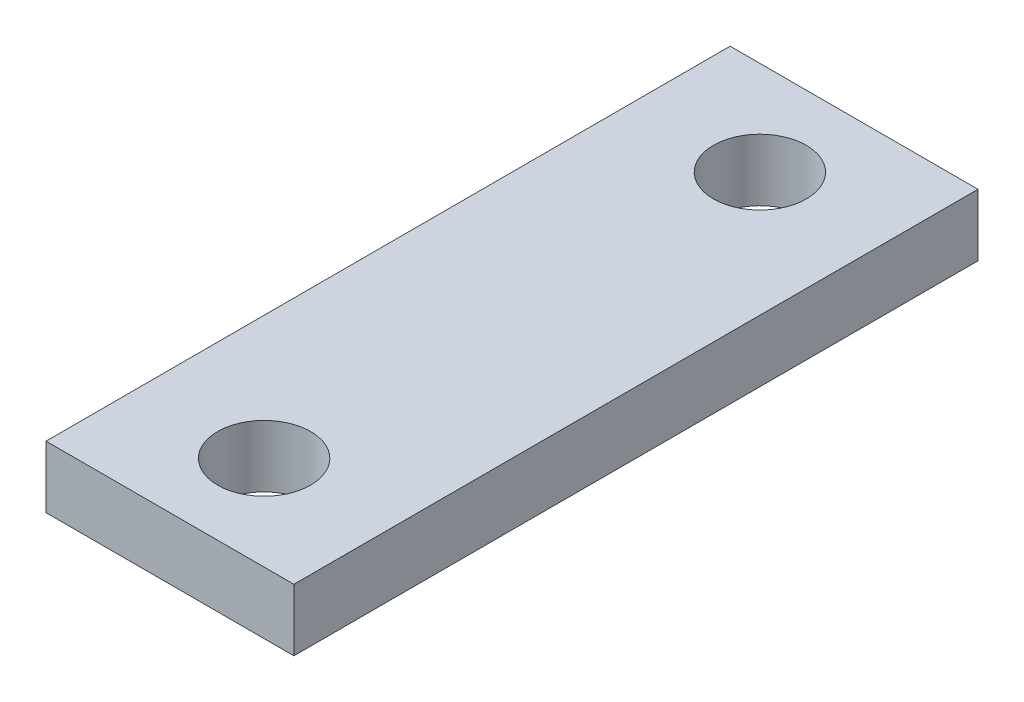
ISO-10303-21;
HEADER;
FILE_DESCRIPTION(('STEP AP214'),'2;1');
FILE_NAME('part.step','',(''),(''),'','','');
FILE_SCHEMA(('AUTOMOTIVE_DESIGN { 1 0 10303 214 1 1 1 1 }'));
ENDSEC;
DATA;
#1=APPLICATION_CONTEXT('core data for automotive mechanical design processes');
#2=APPLICATION_PROTOCOL_DEFINITION('international standard','automotive_design',2000,#1);
#3=PRODUCT_CONTEXT('',#1,'mechanical');
#4=PRODUCT('Part','Part','',(#3));
#5=PRODUCT_RELATED_PRODUCT_CATEGORY('part','',(#4));
#6=PRODUCT_DEFINITION_FORMATION('','',#4);
#7=PRODUCT_DEFINITION_CONTEXT('part definition',#1,'design');
#8=PRODUCT_DEFINITION('design','',#6,#7);
#9=PRODUCT_DEFINITION_SHAPE('','',#8);
#10=(LENGTH_UNIT() NAMED_UNIT(*) SI_UNIT(.MILLI.,.METRE.));
#11=(NAMED_UNIT(*) PLANE_ANGLE_UNIT() SI_UNIT($,.RADIAN.));
#12=(NAMED_UNIT(*) SI_UNIT($,.STERADIAN.) SOLID_ANGLE_UNIT());
#13=UNCERTAINTY_MEASURE_WITH_UNIT(LENGTH_MEASURE(1.E-05),#10,'distance_accuracy_value','');
#14=(GEOMETRIC_REPRESENTATION_CONTEXT(3) GLOBAL_UNCERTAINTY_ASSIGNED_CONTEXT((#13)) GLOBAL_UNIT_ASSIGNED_CONTEXT((#10,
#11,#12)) REPRESENTATION_CONTEXT('',''));
#15=CARTESIAN_POINT('',(0.,0.,0.));
#16=DIRECTION('',(0.,0.,1.));
#17=DIRECTION('',(1.,0.,0.));
#18=AXIS2_PLACEMENT_3D('',#15,#16,#17);
#19=CARTESIAN_POINT('',(-12.7,6.35,0.));
#20=DIRECTION('',(1.,0.,0.));
#21=DIRECTION('',(0.,0.,-1.));
#22=AXIS2_PLACEMENT_3D('',#19,#20,#21);
#23=PLANE('',#22);
#24=DIRECTION('',(0.,0.,1.));
#25=VECTOR('',#24,1.);
#26=CARTESIAN_POINT('',(-12.7,0.,0.));
#27=LINE('',#26,#25);
#28=CARTESIAN_POINT('',(-12.7,0.,-35.052));
#29=VERTEX_POINT('',#28);
#30=CARTESIAN_POINT('',(-12.7,0.,35.052));
#31=VERTEX_POINT('',#30);
#32=EDGE_CURVE('E109',#29,#31,#27,.T.);
#33=ORIENTED_EDGE('',*,*,#32,.T.);
#34=DIRECTION('',(0.,-1.,0.));
#35=VECTOR('',#34,1.);
#36=CARTESIAN_POINT('',(-12.7,6.35,35.052));
#37=LINE('',#36,#35);
#38=CARTESIAN_POINT('',(-12.7,6.35,35.052));
#39=VERTEX_POINT('',#38);
#40=EDGE_CURVE('E11',#39,#31,#37,.T.);
#41=ORIENTED_EDGE('',*,*,#40,.F.);
#42=DIRECTION('',(0.,0.,1.));
#43=VECTOR('',#42,1.);
#44=CARTESIAN_POINT('',(-12.7,6.35,0.));
#45=LINE('',#44,#43);
#46=CARTESIAN_POINT('',(-12.7,6.35,-35.052));
#47=VERTEX_POINT('',#46);
#48=EDGE_CURVE('E89',#47,#39,#45,.T.);
#49=ORIENTED_EDGE('',*,*,#48,.F.);
#50=DIRECTION('',(0.,-1.,0.));
#51=VECTOR('',#50,1.);
#52=CARTESIAN_POINT('',(-12.7,6.35,-35.052));
#53=LINE('',#52,#51);
#54=EDGE_CURVE('E55',#47,#29,#53,.T.);
#55=ORIENTED_EDGE('',*,*,#54,.T.);
#56=EDGE_LOOP('',(#33,#41,#49,#55));
#57=FACE_BOUND('',#56,.T.);
#58=ADVANCED_FACE('F39',(#57),#23,.F.);
#59=CARTESIAN_POINT('',(0.,6.35,35.052));
#60=DIRECTION('',(0.,0.,-1.));
#61=DIRECTION('',(-1.,0.,0.));
#62=AXIS2_PLACEMENT_3D('',#59,#60,#61);
#63=PLANE('',#62);
#64=DIRECTION('',(1.,0.,0.));
#65=VECTOR('',#64,1.);
#66=CARTESIAN_POINT('',(0.,0.,35.052));
#67=LINE('',#66,#65);
#68=CARTESIAN_POINT('',(12.7,0.,35.052));
#69=VERTEX_POINT('',#68);
#70=EDGE_CURVE('E94',#31,#69,#67,.T.);
#71=ORIENTED_EDGE('',*,*,#70,.T.);
#72=DIRECTION('',(0.,-1.,0.));
#73=VECTOR('',#72,1.);
#74=CARTESIAN_POINT('',(12.7,6.35,35.052));
#75=LINE('',#74,#73);
#76=CARTESIAN_POINT('',(12.7,6.35,35.052));
#77=VERTEX_POINT('',#76);
#78=EDGE_CURVE('E47',#77,#69,#75,.T.);
#79=ORIENTED_EDGE('',*,*,#78,.F.);
#80=DIRECTION('',(1.,0.,0.));
#81=VECTOR('',#80,1.);
#82=CARTESIAN_POINT('',(0.,6.35,35.052));
#83=LINE('',#82,#81);
#84=EDGE_CURVE('E80',#39,#77,#83,.T.);
#85=ORIENTED_EDGE('',*,*,#84,.F.);
#86=ORIENTED_EDGE('',*,*,#40,.T.);
#87=EDGE_LOOP('',(#71,#79,#85,#86));
#88=FACE_BOUND('',#87,.T.);
#89=ADVANCED_FACE('F93',(#88),#63,.F.);
#90=CARTESIAN_POINT('',(12.7,6.35,0.));
#91=DIRECTION('',(1.,0.,0.));
#92=DIRECTION('',(0.,0.,-1.));
#93=AXIS2_PLACEMENT_3D('',#90,#91,#92);
#94=PLANE('',#93);
#95=DIRECTION('',(0.,0.,1.));
#96=VECTOR('',#95,1.);
#97=CARTESIAN_POINT('',(12.7,0.,0.));
#98=LINE('',#97,#96);
#99=CARTESIAN_POINT('',(12.7,0.,-35.052));
#100=VERTEX_POINT('',#99);
#101=EDGE_CURVE('E112',#100,#69,#98,.T.);
#102=ORIENTED_EDGE('',*,*,#101,.F.);
#103=DIRECTION('',(0.,-1.,0.));
#104=VECTOR('',#103,1.);
#105=CARTESIAN_POINT('',(12.7,6.35,-35.052));
#106=LINE('',#105,#104);
#107=CARTESIAN_POINT('',(12.7,6.35,-35.052));
#108=VERTEX_POINT('',#107);
#109=EDGE_CURVE('E69',#108,#100,#106,.T.);
#110=ORIENTED_EDGE('',*,*,#109,.F.);
#111=DIRECTION('',(0.,0.,1.));
#112=VECTOR('',#111,1.);
#113=CARTESIAN_POINT('',(12.7,6.35,0.));
#114=LINE('',#113,#112);
#115=EDGE_CURVE('E88',#108,#77,#114,.T.);
#116=ORIENTED_EDGE('',*,*,#115,.T.);
#117=ORIENTED_EDGE('',*,*,#78,.T.);
#118=EDGE_LOOP('',(#102,#110,#116,#117));
#119=FACE_BOUND('',#118,.T.);
#120=ADVANCED_FACE('F97',(#119),#94,.T.);
#121=CARTESIAN_POINT('',(0.,6.35,-25.4));
#122=DIRECTION('',(0.,-1.,0.));
#123=DIRECTION('',(0.,0.,-1.));
#124=AXIS2_PLACEMENT_3D('',#121,#122,#123);
#125=CYLINDRICAL_SURFACE('',#124,4.7625);
#126=CARTESIAN_POINT('',(0.,6.35,-25.4));
#127=DIRECTION('',(0.,1.,0.));
#128=DIRECTION('',(0.,0.,1.));
#129=AXIS2_PLACEMENT_3D('',#126,#127,#128);
#130=CIRCLE('',#129,4.7625);
#131=CARTESIAN_POINT('',(0.,6.35,-20.6375));
#132=VERTEX_POINT('',#131);
#133=EDGE_CURVE('E100',#132,#132,#130,.T.);
#134=ORIENTED_EDGE('',*,*,#133,.T.);
#135=EDGE_LOOP('',(#134));
#136=FACE_BOUND('',#135,.T.);
#137=CARTESIAN_POINT('',(0.,0.,-25.4));
#138=DIRECTION('',(0.,1.,0.));
#139=DIRECTION('',(0.,0.,1.));
#140=AXIS2_PLACEMENT_3D('',#137,#138,#139);
#141=CIRCLE('',#140,4.7625);
#142=CARTESIAN_POINT('',(0.,0.,-20.6375));
#143=VERTEX_POINT('',#142);
#144=EDGE_CURVE('E117',#143,#143,#141,.T.);
#145=ORIENTED_EDGE('',*,*,#144,.F.);
#146=EDGE_LOOP('',(#145));
#147=FACE_BOUND('',#146,.T.);
#148=ADVANCED_FACE('F144',(#136,#147),#125,.F.);
#149=CARTESIAN_POINT('',(0.,6.35,-35.052));
#150=DIRECTION('',(0.,0.,-1.));
#151=DIRECTION('',(-1.,0.,0.));
#152=AXIS2_PLACEMENT_3D('',#149,#150,#151);
#153=PLANE('',#152);
#154=DIRECTION('',(1.,0.,0.));
#155=VECTOR('',#154,1.);
#156=CARTESIAN_POINT('',(0.,0.,-35.052));
#157=LINE('',#156,#155);
#158=EDGE_CURVE('E114',#29,#100,#157,.T.);
#159=ORIENTED_EDGE('',*,*,#158,.F.);
#160=ORIENTED_EDGE('',*,*,#54,.F.);
#161=DIRECTION('',(1.,0.,0.));
#162=VECTOR('',#161,1.);
#163=CARTESIAN_POINT('',(0.,6.35,-35.052));
#164=LINE('',#163,#162);
#165=EDGE_CURVE('E98',#47,#108,#164,.T.);
#166=ORIENTED_EDGE('',*,*,#165,.T.);
#167=ORIENTED_EDGE('',*,*,#109,.T.);
#168=EDGE_LOOP('',(#159,#160,#166,#167));
#169=FACE_BOUND('',#168,.T.);
#170=ADVANCED_FACE('F142',(#169),#153,.T.);
#171=CARTESIAN_POINT('',(0.,6.35,25.4));
#172=DIRECTION('',(0.,-1.,0.));
#173=DIRECTION('',(0.,0.,-1.));
#174=AXIS2_PLACEMENT_3D('',#171,#172,#173);
#175=CYLINDRICAL_SURFACE('',#174,4.7625);
#176=CARTESIAN_POINT('',(0.,6.35,25.4));
#177=DIRECTION('',(0.,1.,0.));
#178=DIRECTION('',(0.,0.,1.));
#179=AXIS2_PLACEMENT_3D('',#176,#177,#178);
#180=CIRCLE('',#179,4.7625);
#181=CARTESIAN_POINT('',(0.,6.35,30.1625));
#182=VERTEX_POINT('',#181);
#183=EDGE_CURVE('E106',#182,#182,#180,.F.);
#184=ORIENTED_EDGE('',*,*,#183,.F.);
#185=EDGE_LOOP('',(#184));
#186=FACE_BOUND('',#185,.T.);
#187=CARTESIAN_POINT('',(0.,0.,25.4));
#188=DIRECTION('',(0.,1.,0.));
#189=DIRECTION('',(0.,0.,1.));
#190=AXIS2_PLACEMENT_3D('',#187,#188,#189);
#191=CIRCLE('',#190,4.7625);
#192=CARTESIAN_POINT('',(0.,0.,30.1625));
#193=VERTEX_POINT('',#192);
#194=EDGE_CURVE('E120',#193,#193,#191,.F.);
#195=ORIENTED_EDGE('',*,*,#194,.T.);
#196=EDGE_LOOP('',(#195));
#197=FACE_BOUND('',#196,.T.);
#198=ADVANCED_FACE('F126',(#186,#197),#175,.F.);
#199=CARTESIAN_POINT('',(0.,6.35,0.));
#200=DIRECTION('',(0.,1.,0.));
#201=DIRECTION('',(0.,0.,1.));
#202=AXIS2_PLACEMENT_3D('',#199,#200,#201);
#203=PLANE('',#202);
#204=ORIENTED_EDGE('',*,*,#48,.T.);
#205=ORIENTED_EDGE('',*,*,#84,.T.);
#206=ORIENTED_EDGE('',*,*,#115,.F.);
#207=ORIENTED_EDGE('',*,*,#165,.F.);
#208=EDGE_LOOP('',(#204,#205,#206,#207));
#209=FACE_BOUND('',#208,.T.);
#210=ORIENTED_EDGE('',*,*,#133,.F.);
#211=EDGE_LOOP('',(#210));
#212=FACE_BOUND('',#211,.T.);
#213=ORIENTED_EDGE('',*,*,#183,.T.);
#214=EDGE_LOOP('',(#213));
#215=FACE_BOUND('',#214,.T.);
#216=ADVANCED_FACE('F84',(#209,#212,#215),#203,.T.);
#217=CARTESIAN_POINT('',(0.,0.,0.));
#218=DIRECTION('',(0.,1.,0.));
#219=DIRECTION('',(0.,0.,1.));
#220=AXIS2_PLACEMENT_3D('',#217,#218,#219);
#221=PLANE('',#220);
#222=ORIENTED_EDGE('',*,*,#32,.F.);
#223=ORIENTED_EDGE('',*,*,#158,.T.);
#224=ORIENTED_EDGE('',*,*,#101,.T.);
#225=ORIENTED_EDGE('',*,*,#70,.F.);
#226=EDGE_LOOP('',(#222,#223,#224,#225));
#227=FACE_BOUND('',#226,.T.);
#228=ORIENTED_EDGE('',*,*,#144,.T.);
#229=EDGE_LOOP('',(#228));
#230=FACE_BOUND('',#229,.T.);
#231=ORIENTED_EDGE('',*,*,#194,.F.);
#232=EDGE_LOOP('',(#231));
#233=FACE_BOUND('',#232,.T.);
#234=ADVANCED_FACE('F128',(#227,#230,#233),#221,.F.);
#235=CLOSED_SHELL('',(#58,#89,#120,#148,#170,#198,#216,#234));
#236=MANIFOLD_SOLID_BREP('B2',#235);
#237=ADVANCED_BREP_SHAPE_REPRESENTATION('',(#18,#236),#14);
#238=SHAPE_DEFINITION_REPRESENTATION(#9,#237);
ENDSEC;
END-ISO-10303-21;
